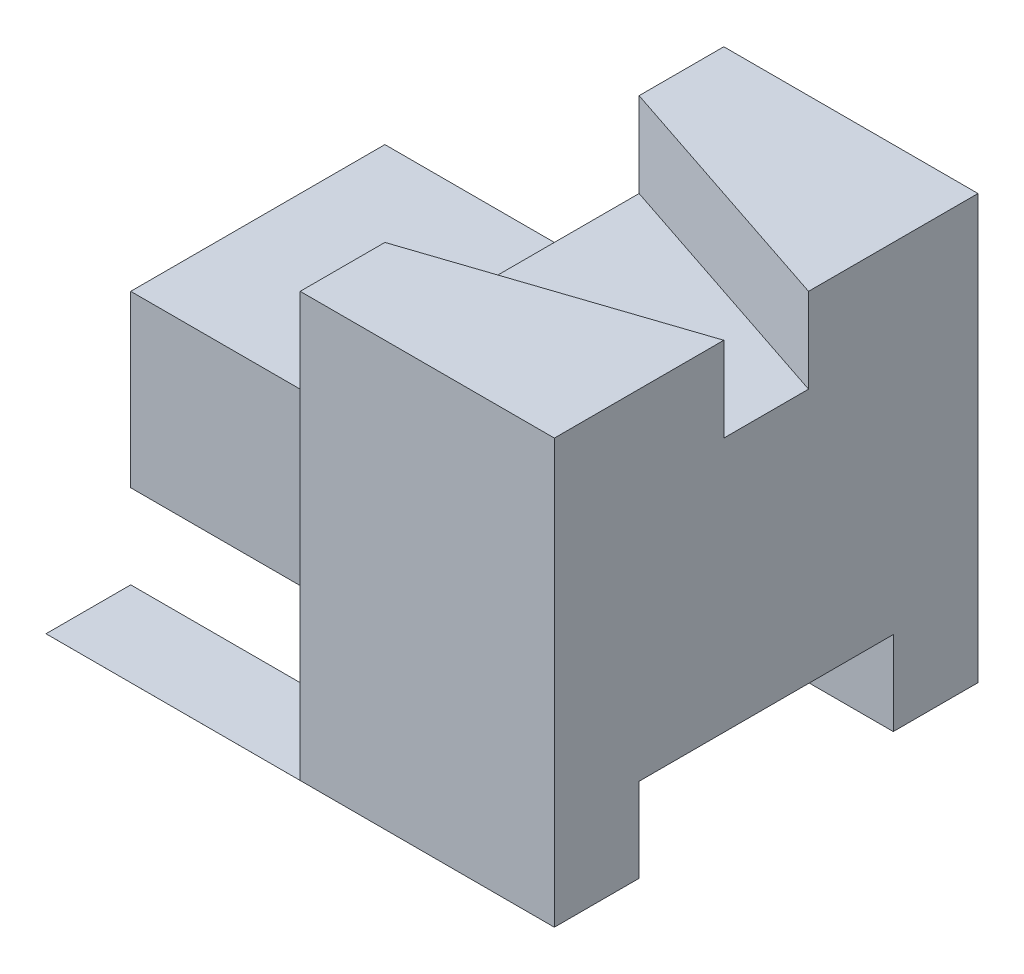
ISO-10303-21;
HEADER;
FILE_DESCRIPTION(('STEP AP214'),'2;1');
FILE_NAME('part.step','',(''),(''),'','','');
FILE_SCHEMA(('AUTOMOTIVE_DESIGN { 1 0 10303 214 1 1 1 1 }'));
ENDSEC;
DATA;
#1=APPLICATION_CONTEXT('core data for automotive mechanical design processes');
#2=APPLICATION_PROTOCOL_DEFINITION('international standard','automotive_design',2000,#1);
#3=PRODUCT_CONTEXT('',#1,'mechanical');
#4=PRODUCT('Part','Part','',(#3));
#5=PRODUCT_RELATED_PRODUCT_CATEGORY('part','',(#4));
#6=PRODUCT_DEFINITION_FORMATION('','',#4);
#7=PRODUCT_DEFINITION_CONTEXT('part definition',#1,'design');
#8=PRODUCT_DEFINITION('design','',#6,#7);
#9=PRODUCT_DEFINITION_SHAPE('','',#8);
#10=(LENGTH_UNIT() NAMED_UNIT(*) SI_UNIT(.MILLI.,.METRE.));
#11=(NAMED_UNIT(*) PLANE_ANGLE_UNIT() SI_UNIT($,.RADIAN.));
#12=(NAMED_UNIT(*) SI_UNIT($,.STERADIAN.) SOLID_ANGLE_UNIT());
#13=UNCERTAINTY_MEASURE_WITH_UNIT(LENGTH_MEASURE(1.E-05),#10,'distance_accuracy_value','');
#14=(GEOMETRIC_REPRESENTATION_CONTEXT(3) GLOBAL_UNCERTAINTY_ASSIGNED_CONTEXT((#13)) GLOBAL_UNIT_ASSIGNED_CONTEXT((#10,
#11,#12)) REPRESENTATION_CONTEXT('',''));
#15=CARTESIAN_POINT('',(0.,0.,0.));
#16=DIRECTION('',(0.,0.,1.));
#17=DIRECTION('',(1.,0.,0.));
#18=AXIS2_PLACEMENT_3D('',#15,#16,#17);
#19=CARTESIAN_POINT('',(30.,0.,40.));
#20=DIRECTION('',(0.,0.,-1.));
#21=DIRECTION('',(-1.,0.,0.));
#22=AXIS2_PLACEMENT_3D('',#19,#20,#21);
#23=PLANE('',#22);
#24=DIRECTION('',(-1.,0.,0.));
#25=VECTOR('',#24,1.);
#26=CARTESIAN_POINT('',(30.,0.,40.));
#27=LINE('',#26,#25);
#28=CARTESIAN_POINT('',(30.,0.,40.));
#29=VERTEX_POINT('',#28);
#30=CARTESIAN_POINT('',(-29.999,0.,40.));
#31=VERTEX_POINT('',#30);
#32=EDGE_CURVE('E234',#29,#31,#27,.T.);
#33=ORIENTED_EDGE('',*,*,#32,.T.);
#34=DIRECTION('',(0.,-1.,0.));
#35=VECTOR('',#34,1.);
#36=CARTESIAN_POINT('',(-29.999,0.001,40.));
#37=LINE('',#36,#35);
#38=CARTESIAN_POINT('',(-29.999,0.001,40.));
#39=VERTEX_POINT('',#38);
#40=EDGE_CURVE('E178',#39,#31,#37,.T.);
#41=ORIENTED_EDGE('',*,*,#40,.F.);
#42=DIRECTION('',(1.,0.,0.));
#43=VECTOR('',#42,1.);
#44=CARTESIAN_POINT('',(0.001,0.001,40.));
#45=LINE('',#44,#43);
#46=CARTESIAN_POINT('',(0.001,0.001,40.));
#47=VERTEX_POINT('',#46);
#48=EDGE_CURVE('E179',#39,#47,#45,.T.);
#49=ORIENTED_EDGE('',*,*,#48,.T.);
#50=DIRECTION('',(0.,-1.,0.));
#51=VECTOR('',#50,1.);
#52=CARTESIAN_POINT('',(0.001,0.,40.));
#53=LINE('',#52,#51);
#54=CARTESIAN_POINT('',(0.001,9.92,40.));
#55=VERTEX_POINT('',#54);
#56=EDGE_CURVE('E50',#55,#47,#53,.T.);
#57=ORIENTED_EDGE('',*,*,#56,.F.);
#58=DIRECTION('',(-1.,0.,0.));
#59=VECTOR('',#58,1.);
#60=CARTESIAN_POINT('',(-30.,9.92,40.));
#61=LINE('',#60,#59);
#62=CARTESIAN_POINT('',(30.,9.92,40.));
#63=VERTEX_POINT('',#62);
#64=EDGE_CURVE('E215',#63,#55,#61,.T.);
#65=ORIENTED_EDGE('',*,*,#64,.F.);
#66=DIRECTION('',(0.,-1.,0.));
#67=VECTOR('',#66,1.);
#68=CARTESIAN_POINT('',(30.,0.,40.));
#69=LINE('',#68,#67);
#70=EDGE_CURVE('E227',#63,#29,#69,.T.);
#71=ORIENTED_EDGE('',*,*,#70,.T.);
#72=EDGE_LOOP('',(#33,#41,#49,#57,#65,#71));
#73=FACE_BOUND('',#72,.T.);
#74=ADVANCED_FACE('F35',(#73),#23,.T.);
#75=CARTESIAN_POINT('',(0.,0.,50.));
#76=DIRECTION('',(0.,1.,0.));
#77=DIRECTION('',(0.,0.,1.));
#78=AXIS2_PLACEMENT_3D('',#75,#76,#77);
#79=PLANE('',#78);
#80=DIRECTION('',(1.,0.,0.));
#81=VECTOR('',#80,1.);
#82=CARTESIAN_POINT('',(0.,0.,50.));
#83=LINE('',#82,#81);
#84=CARTESIAN_POINT('',(-29.999,0.,50.));
#85=VERTEX_POINT('',#84);
#86=CARTESIAN_POINT('',(30.,0.,50.));
#87=VERTEX_POINT('',#86);
#88=EDGE_CURVE('E320',#85,#87,#83,.T.);
#89=ORIENTED_EDGE('',*,*,#88,.F.);
#90=DIRECTION('',(0.,0.,-1.));
#91=VECTOR('',#90,1.);
#92=CARTESIAN_POINT('',(-29.999,0.,50.));
#93=LINE('',#92,#91);
#94=EDGE_CURVE('E175',#85,#31,#93,.T.);
#95=ORIENTED_EDGE('',*,*,#94,.T.);
#96=ORIENTED_EDGE('',*,*,#32,.F.);
#97=DIRECTION('',(0.,0.,-1.));
#98=VECTOR('',#97,1.);
#99=CARTESIAN_POINT('',(30.,0.,50.));
#100=LINE('',#99,#98);
#101=EDGE_CURVE('E305',#87,#29,#100,.T.);
#102=ORIENTED_EDGE('',*,*,#101,.F.);
#103=EDGE_LOOP('',(#89,#95,#96,#102));
#104=FACE_BOUND('',#103,.T.);
#105=ADVANCED_FACE('F371',(#104),#79,.F.);
#106=CARTESIAN_POINT('',(-30.,30.,20.));
#107=DIRECTION('',(-1.,0.,0.));
#108=DIRECTION('',(0.,-1.,0.));
#109=AXIS2_PLACEMENT_3D('',#106,#107,#108);
#110=PLANE('',#109);
#111=DIRECTION('',(0.,0.,-1.));
#112=VECTOR('',#111,1.);
#113=CARTESIAN_POINT('',(-30.,9.92,10.));
#114=LINE('',#113,#112);
#115=CARTESIAN_POINT('',(-30.,9.91999999999999,40.));
#116=VERTEX_POINT('',#115);
#117=CARTESIAN_POINT('',(-30.,9.92,10.));
#118=VERTEX_POINT('',#117);
#119=EDGE_CURVE('E205',#116,#118,#114,.T.);
#120=ORIENTED_EDGE('',*,*,#119,.F.);
#121=DIRECTION('',(0.,-1.,0.));
#122=VECTOR('',#121,1.);
#123=CARTESIAN_POINT('',(-30.,10.,40.));
#124=LINE('',#123,#122);
#125=CARTESIAN_POINT('',(-30.,30.,40.));
#126=VERTEX_POINT('',#125);
#127=EDGE_CURVE('E338',#126,#116,#124,.T.);
#128=ORIENTED_EDGE('',*,*,#127,.F.);
#129=DIRECTION('',(0.,0.,1.));
#130=VECTOR('',#129,1.);
#131=CARTESIAN_POINT('',(-30.,30.,20.));
#132=LINE('',#131,#130);
#133=CARTESIAN_POINT('',(-30.,30.,10.));
#134=VERTEX_POINT('',#133);
#135=EDGE_CURVE('E328',#134,#126,#132,.T.);
#136=ORIENTED_EDGE('',*,*,#135,.F.);
#137=DIRECTION('',(0.,1.,0.));
#138=VECTOR('',#137,1.);
#139=CARTESIAN_POINT('',(-30.,30.,10.));
#140=LINE('',#139,#138);
#141=EDGE_CURVE('E303',#118,#134,#140,.T.);
#142=ORIENTED_EDGE('',*,*,#141,.F.);
#143=EDGE_LOOP('',(#120,#128,#136,#142));
#144=FACE_BOUND('',#143,.T.);
#145=ADVANCED_FACE('F397',(#144),#110,.T.);
#146=CARTESIAN_POINT('',(30.,0.,10.));
#147=DIRECTION('',(0.,0.,1.));
#148=DIRECTION('',(1.,0.,0.));
#149=AXIS2_PLACEMENT_3D('',#146,#147,#148);
#150=PLANE('',#149);
#151=DIRECTION('',(0.,1.,0.));
#152=VECTOR('',#151,1.);
#153=CARTESIAN_POINT('',(30.,0.,10.));
#154=LINE('',#153,#152);
#155=CARTESIAN_POINT('',(30.,0.,10.));
#156=VERTEX_POINT('',#155);
#157=CARTESIAN_POINT('',(30.,9.92,10.));
#158=VERTEX_POINT('',#157);
#159=EDGE_CURVE('E229',#156,#158,#154,.T.);
#160=ORIENTED_EDGE('',*,*,#159,.T.);
#161=DIRECTION('',(-1.,0.,0.));
#162=VECTOR('',#161,1.);
#163=CARTESIAN_POINT('',(30.,9.92,10.));
#164=LINE('',#163,#162);
#165=CARTESIAN_POINT('',(-22.56,9.92,10.));
#166=VERTEX_POINT('',#165);
#167=EDGE_CURVE('E11',#158,#166,#164,.T.);
#168=ORIENTED_EDGE('',*,*,#167,.T.);
#169=DIRECTION('',(0.6,0.8,0.));
#170=VECTOR('',#169,1.);
#171=CARTESIAN_POINT('',(-30.,0.,10.));
#172=LINE('',#171,#170);
#173=CARTESIAN_POINT('',(-30.,0.,10.));
#174=VERTEX_POINT('',#173);
#175=EDGE_CURVE('E43',#174,#166,#172,.T.);
#176=ORIENTED_EDGE('',*,*,#175,.F.);
#177=DIRECTION('',(-1.,0.,0.));
#178=VECTOR('',#177,1.);
#179=CARTESIAN_POINT('',(30.,0.,10.));
#180=LINE('',#179,#178);
#181=EDGE_CURVE('E231',#156,#174,#180,.T.);
#182=ORIENTED_EDGE('',*,*,#181,.F.);
#183=EDGE_LOOP('',(#160,#168,#176,#182));
#184=FACE_BOUND('',#183,.T.);
#185=ADVANCED_FACE('F362',(#184),#150,.T.);
#186=CARTESIAN_POINT('',(-30.,0.,0.));
#187=DIRECTION('',(-0.8,0.6,0.));
#188=DIRECTION('',(-0.6,-0.8,0.));
#189=AXIS2_PLACEMENT_3D('',#186,#187,#188);
#190=PLANE('',#189);
#191=DIRECTION('',(0.6,0.8,0.));
#192=VECTOR('',#191,1.);
#193=CARTESIAN_POINT('',(-19.2,14.4,10.));
#194=LINE('',#193,#192);
#195=CARTESIAN_POINT('',(-7.5,30.,10.));
#196=VERTEX_POINT('',#195);
#197=EDGE_CURVE('E285',#166,#196,#194,.T.);
#198=ORIENTED_EDGE('',*,*,#197,.T.);
#199=DIRECTION('',(-0.6,-0.8,0.));
#200=VECTOR('',#199,1.);
#201=CARTESIAN_POINT('',(0.,40.,10.));
#202=LINE('',#201,#200);
#203=CARTESIAN_POINT('',(0.,40.,10.));
#204=VERTEX_POINT('',#203);
#205=EDGE_CURVE('E218',#204,#196,#202,.T.);
#206=ORIENTED_EDGE('',*,*,#205,.F.);
#207=DIRECTION('',(0.,0.,1.));
#208=VECTOR('',#207,1.);
#209=CARTESIAN_POINT('',(0.,40.,0.));
#210=LINE('',#209,#208);
#211=CARTESIAN_POINT('',(0.,40.,0.));
#212=VERTEX_POINT('',#211);
#213=EDGE_CURVE('E289',#212,#204,#210,.T.);
#214=ORIENTED_EDGE('',*,*,#213,.F.);
#215=DIRECTION('',(-0.6,-0.8,0.));
#216=VECTOR('',#215,1.);
#217=CARTESIAN_POINT('',(-30.,0.,0.));
#218=LINE('',#217,#216);
#219=CARTESIAN_POINT('',(-30.,0.,0.));
#220=VERTEX_POINT('',#219);
#221=EDGE_CURVE('E277',#212,#220,#218,.T.);
#222=ORIENTED_EDGE('',*,*,#221,.T.);
#223=DIRECTION('',(0.,0.,1.));
#224=VECTOR('',#223,1.);
#225=CARTESIAN_POINT('',(-30.,0.,0.));
#226=LINE('',#225,#224);
#227=EDGE_CURVE('E282',#220,#174,#226,.T.);
#228=ORIENTED_EDGE('',*,*,#227,.T.);
#229=ORIENTED_EDGE('',*,*,#175,.T.);
#230=EDGE_LOOP('',(#198,#206,#214,#222,#228,#229));
#231=FACE_BOUND('',#230,.T.);
#232=ADVANCED_FACE('F359',(#231),#190,.T.);
#233=CARTESIAN_POINT('',(0.,0.,50.));
#234=DIRECTION('',(1.,0.,0.));
#235=DIRECTION('',(0.,0.,-1.));
#236=AXIS2_PLACEMENT_3D('',#233,#234,#235);
#237=PLANE('',#236);
#238=DIRECTION('',(0.,1.,0.));
#239=VECTOR('',#238,1.);
#240=CARTESIAN_POINT('',(0.,10.,40.));
#241=LINE('',#240,#239);
#242=CARTESIAN_POINT('',(0.,9.92,40.));
#243=VERTEX_POINT('',#242);
#244=CARTESIAN_POINT('',(0.,30.,40.));
#245=VERTEX_POINT('',#244);
#246=EDGE_CURVE('E343',#243,#245,#241,.T.);
#247=ORIENTED_EDGE('',*,*,#246,.F.);
#248=DIRECTION('',(0.,0.,-1.));
#249=VECTOR('',#248,1.);
#250=CARTESIAN_POINT('',(0.,9.92,50.));
#251=LINE('',#250,#249);
#252=CARTESIAN_POINT('',(0.,9.92,50.));
#253=VERTEX_POINT('',#252);
#254=EDGE_CURVE('E196',#253,#243,#251,.T.);
#255=ORIENTED_EDGE('',*,*,#254,.F.);
#256=DIRECTION('',(0.,-1.,0.));
#257=VECTOR('',#256,1.);
#258=CARTESIAN_POINT('',(0.,0.,50.));
#259=LINE('',#258,#257);
#260=CARTESIAN_POINT('',(0.,50.,50.));
#261=VERTEX_POINT('',#260);
#262=EDGE_CURVE('E318',#261,#253,#259,.T.);
#263=ORIENTED_EDGE('',*,*,#262,.F.);
#264=DIRECTION('',(0.,0.,1.));
#265=VECTOR('',#264,1.);
#266=CARTESIAN_POINT('',(0.,50.,45.));
#267=LINE('',#266,#265);
#268=CARTESIAN_POINT('',(0.,50.,40.));
#269=VERTEX_POINT('',#268);
#270=EDGE_CURVE('E274',#269,#261,#267,.T.);
#271=ORIENTED_EDGE('',*,*,#270,.F.);
#272=DIRECTION('',(0.,1.,0.));
#273=VECTOR('',#272,1.);
#274=CARTESIAN_POINT('',(0.,50.,40.));
#275=LINE('',#274,#273);
#276=CARTESIAN_POINT('',(0.,40.,40.));
#277=VERTEX_POINT('',#276);
#278=EDGE_CURVE('E267',#277,#269,#275,.T.);
#279=ORIENTED_EDGE('',*,*,#278,.F.);
#280=EDGE_CURVE('E288',#204,#277,#210,.T.);
#281=ORIENTED_EDGE('',*,*,#280,.F.);
#282=DIRECTION('',(0.,1.,0.));
#283=VECTOR('',#282,1.);
#284=CARTESIAN_POINT('',(0.,30.,10.));
#285=LINE('',#284,#283);
#286=CARTESIAN_POINT('',(0.,30.,10.));
#287=VERTEX_POINT('',#286);
#288=EDGE_CURVE('E224',#287,#204,#285,.T.);
#289=ORIENTED_EDGE('',*,*,#288,.F.);
#290=DIRECTION('',(0.,0.,1.));
#291=VECTOR('',#290,1.);
#292=CARTESIAN_POINT('',(0.,30.,20.));
#293=LINE('',#292,#291);
#294=EDGE_CURVE('E300',#287,#245,#293,.T.);
#295=ORIENTED_EDGE('',*,*,#294,.T.);
#296=EDGE_LOOP('',(#247,#255,#263,#271,#279,#281,#289,#295));
#297=FACE_BOUND('',#296,.T.);
#298=ADVANCED_FACE('F37',(#297),#237,.F.);
#299=CARTESIAN_POINT('',(30.,0.,50.));
#300=DIRECTION('',(-1.,0.,0.));
#301=DIRECTION('',(0.,0.,1.));
#302=AXIS2_PLACEMENT_3D('',#299,#300,#301);
#303=PLANE('',#302);
#304=ORIENTED_EDGE('',*,*,#70,.F.);
#305=DIRECTION('',(0.,0.,1.));
#306=VECTOR('',#305,1.);
#307=CARTESIAN_POINT('',(30.,9.92,10.));
#308=LINE('',#307,#306);
#309=EDGE_CURVE('E211',#158,#63,#308,.T.);
#310=ORIENTED_EDGE('',*,*,#309,.F.);
#311=ORIENTED_EDGE('',*,*,#159,.F.);
#312=CARTESIAN_POINT('',(30.,0.,0.));
#313=VERTEX_POINT('',#312);
#314=EDGE_CURVE('E308',#156,#313,#100,.T.);
#315=ORIENTED_EDGE('',*,*,#314,.T.);
#316=DIRECTION('',(0.,1.,0.));
#317=VECTOR('',#316,1.);
#318=CARTESIAN_POINT('',(30.,0.,0.));
#319=LINE('',#318,#317);
#320=CARTESIAN_POINT('',(30.,50.,0.));
#321=VERTEX_POINT('',#320);
#322=EDGE_CURVE('E316',#313,#321,#319,.T.);
#323=ORIENTED_EDGE('',*,*,#322,.T.);
#324=DIRECTION('',(0.,0.,-1.));
#325=VECTOR('',#324,1.);
#326=CARTESIAN_POINT('',(30.,50.,0.));
#327=LINE('',#326,#325);
#328=CARTESIAN_POINT('',(30.,50.,20.));
#329=VERTEX_POINT('',#328);
#330=EDGE_CURVE('E242',#329,#321,#327,.T.);
#331=ORIENTED_EDGE('',*,*,#330,.F.);
#332=DIRECTION('',(0.,-1.,0.));
#333=VECTOR('',#332,1.);
#334=CARTESIAN_POINT('',(30.,50.,20.));
#335=LINE('',#334,#333);
#336=CARTESIAN_POINT('',(30.,40.,20.));
#337=VERTEX_POINT('',#336);
#338=EDGE_CURVE('E252',#329,#337,#335,.T.);
#339=ORIENTED_EDGE('',*,*,#338,.T.);
#340=DIRECTION('',(0.,0.,-1.));
#341=VECTOR('',#340,1.);
#342=CARTESIAN_POINT('',(30.,40.,0.));
#343=LINE('',#342,#341);
#344=CARTESIAN_POINT('',(30.,40.,30.));
#345=VERTEX_POINT('',#344);
#346=EDGE_CURVE('E293',#345,#337,#343,.T.);
#347=ORIENTED_EDGE('',*,*,#346,.F.);
#348=DIRECTION('',(0.,-1.,0.));
#349=VECTOR('',#348,1.);
#350=CARTESIAN_POINT('',(30.,50.,30.));
#351=LINE('',#350,#349);
#352=CARTESIAN_POINT('',(30.,50.,30.));
#353=VERTEX_POINT('',#352);
#354=EDGE_CURVE('E262',#353,#345,#351,.T.);
#355=ORIENTED_EDGE('',*,*,#354,.F.);
#356=DIRECTION('',(0.,0.,1.));
#357=VECTOR('',#356,1.);
#358=CARTESIAN_POINT('',(30.,50.,45.));
#359=LINE('',#358,#357);
#360=CARTESIAN_POINT('',(30.,50.,50.));
#361=VERTEX_POINT('',#360);
#362=EDGE_CURVE('E273',#353,#361,#359,.T.);
#363=ORIENTED_EDGE('',*,*,#362,.T.);
#364=DIRECTION('',(0.,1.,0.));
#365=VECTOR('',#364,1.);
#366=CARTESIAN_POINT('',(30.,0.,50.));
#367=LINE('',#366,#365);
#368=EDGE_CURVE('E314',#87,#361,#367,.T.);
#369=ORIENTED_EDGE('',*,*,#368,.F.);
#370=ORIENTED_EDGE('',*,*,#101,.T.);
#371=EDGE_LOOP('',(#304,#310,#311,#315,#323,#331,#339,#347,#355,#363,#369,#370));
#372=FACE_BOUND('',#371,.T.);
#373=ADVANCED_FACE('F367',(#372),#303,.F.);
#374=ORIENTED_EDGE('',*,*,#181,.T.);
#375=ORIENTED_EDGE('',*,*,#227,.F.);
#376=DIRECTION('',(1.,0.,0.));
#377=VECTOR('',#376,1.);
#378=CARTESIAN_POINT('',(0.,0.,0.));
#379=LINE('',#378,#377);
#380=EDGE_CURVE('E326',#220,#313,#379,.T.);
#381=ORIENTED_EDGE('',*,*,#380,.T.);
#382=ORIENTED_EDGE('',*,*,#314,.F.);
#383=EDGE_LOOP('',(#374,#375,#381,#382));
#384=FACE_BOUND('',#383,.T.);
#385=ADVANCED_FACE('F398',(#384),#79,.F.);
#386=CARTESIAN_POINT('',(0.,40.,0.));
#387=DIRECTION('',(0.,1.,0.));
#388=DIRECTION('',(0.,0.,1.));
#389=AXIS2_PLACEMENT_3D('',#386,#387,#388);
#390=PLANE('',#389);
#391=ORIENTED_EDGE('',*,*,#346,.T.);
#392=DIRECTION('',(0.948683298050514,0.,0.316227766016838));
#393=VECTOR('',#392,1.);
#394=CARTESIAN_POINT('',(30.,40.,20.));
#395=LINE('',#394,#393);
#396=EDGE_CURVE('E236',#204,#337,#395,.T.);
#397=ORIENTED_EDGE('',*,*,#396,.F.);
#398=ORIENTED_EDGE('',*,*,#280,.T.);
#399=DIRECTION('',(-0.948683298050514,0.,0.316227766016838));
#400=VECTOR('',#399,1.);
#401=CARTESIAN_POINT('',(0.,40.,40.));
#402=LINE('',#401,#400);
#403=EDGE_CURVE('E258',#345,#277,#402,.T.);
#404=ORIENTED_EDGE('',*,*,#403,.F.);
#405=EDGE_LOOP('',(#391,#397,#398,#404));
#406=FACE_BOUND('',#405,.T.);
#407=ADVANCED_FACE('F422',(#406),#390,.T.);
#408=CARTESIAN_POINT('',(0.,0.,50.));
#409=DIRECTION('',(0.,0.,-1.));
#410=DIRECTION('',(-1.,0.,0.));
#411=AXIS2_PLACEMENT_3D('',#408,#409,#410);
#412=PLANE('',#411);
#413=ORIENTED_EDGE('',*,*,#262,.T.);
#414=DIRECTION('',(-1.,0.,0.));
#415=VECTOR('',#414,1.);
#416=CARTESIAN_POINT('',(0.001,9.92,50.));
#417=LINE('',#416,#415);
#418=CARTESIAN_POINT('',(0.001,9.92,50.));
#419=VERTEX_POINT('',#418);
#420=EDGE_CURVE('E202',#419,#253,#417,.T.);
#421=ORIENTED_EDGE('',*,*,#420,.F.);
#422=DIRECTION('',(0.,1.,0.));
#423=VECTOR('',#422,1.);
#424=CARTESIAN_POINT('',(0.001,0.,50.));
#425=LINE('',#424,#423);
#426=CARTESIAN_POINT('',(0.001,0.001,50.));
#427=VERTEX_POINT('',#426);
#428=EDGE_CURVE('E190',#427,#419,#425,.T.);
#429=ORIENTED_EDGE('',*,*,#428,.F.);
#430=DIRECTION('',(-1.,0.,0.));
#431=VECTOR('',#430,1.);
#432=CARTESIAN_POINT('',(0.001,0.001,50.));
#433=LINE('',#432,#431);
#434=CARTESIAN_POINT('',(-29.999,0.001,50.));
#435=VERTEX_POINT('',#434);
#436=EDGE_CURVE('E184',#427,#435,#433,.T.);
#437=ORIENTED_EDGE('',*,*,#436,.T.);
#438=DIRECTION('',(0.,-1.,0.));
#439=VECTOR('',#438,1.);
#440=CARTESIAN_POINT('',(-29.999,0.001,50.));
#441=LINE('',#440,#439);
#442=EDGE_CURVE('E168',#435,#85,#441,.T.);
#443=ORIENTED_EDGE('',*,*,#442,.T.);
#444=ORIENTED_EDGE('',*,*,#88,.T.);
#445=ORIENTED_EDGE('',*,*,#368,.T.);
#446=DIRECTION('',(-1.,0.,0.));
#447=VECTOR('',#446,1.);
#448=CARTESIAN_POINT('',(30.,50.,50.));
#449=LINE('',#448,#447);
#450=EDGE_CURVE('E270',#361,#261,#449,.T.);
#451=ORIENTED_EDGE('',*,*,#450,.T.);
#452=EDGE_LOOP('',(#413,#421,#429,#437,#443,#444,#445,#451));
#453=FACE_BOUND('',#452,.T.);
#454=ADVANCED_FACE('F188',(#453),#412,.F.);
#455=CARTESIAN_POINT('',(0.,0.,0.));
#456=DIRECTION('',(0.,0.,-1.));
#457=DIRECTION('',(-1.,0.,0.));
#458=AXIS2_PLACEMENT_3D('',#455,#456,#457);
#459=PLANE('',#458);
#460=ORIENTED_EDGE('',*,*,#380,.F.);
#461=ORIENTED_EDGE('',*,*,#221,.F.);
#462=DIRECTION('',(0.,-1.,0.));
#463=VECTOR('',#462,1.);
#464=CARTESIAN_POINT('',(0.,50.,0.));
#465=LINE('',#464,#463);
#466=CARTESIAN_POINT('',(0.,50.,0.));
#467=VERTEX_POINT('',#466);
#468=EDGE_CURVE('E247',#467,#212,#465,.T.);
#469=ORIENTED_EDGE('',*,*,#468,.F.);
#470=DIRECTION('',(-1.,0.,0.));
#471=VECTOR('',#470,1.);
#472=CARTESIAN_POINT('',(0.,50.,0.));
#473=LINE('',#472,#471);
#474=EDGE_CURVE('E245',#321,#467,#473,.T.);
#475=ORIENTED_EDGE('',*,*,#474,.F.);
#476=ORIENTED_EDGE('',*,*,#322,.F.);
#477=EDGE_LOOP('',(#460,#461,#469,#475,#476));
#478=FACE_BOUND('',#477,.T.);
#479=ADVANCED_FACE('F436',(#478),#459,.T.);
#480=CARTESIAN_POINT('',(0.,30.,20.));
#481=DIRECTION('',(0.,1.,0.));
#482=DIRECTION('',(-1.,0.,0.));
#483=AXIS2_PLACEMENT_3D('',#480,#481,#482);
#484=PLANE('',#483);
#485=DIRECTION('',(1.,0.,0.));
#486=VECTOR('',#485,1.);
#487=CARTESIAN_POINT('',(-7.5,30.,10.));
#488=LINE('',#487,#486);
#489=EDGE_CURVE('E221',#196,#287,#488,.T.);
#490=ORIENTED_EDGE('',*,*,#489,.F.);
#491=DIRECTION('',(1.,0.,0.));
#492=VECTOR('',#491,1.);
#493=CARTESIAN_POINT('',(0.,30.,10.));
#494=LINE('',#493,#492);
#495=EDGE_CURVE('E345',#134,#196,#494,.T.);
#496=ORIENTED_EDGE('',*,*,#495,.F.);
#497=ORIENTED_EDGE('',*,*,#135,.T.);
#498=DIRECTION('',(-1.,0.,0.));
#499=VECTOR('',#498,1.);
#500=CARTESIAN_POINT('',(0.,30.,40.));
#501=LINE('',#500,#499);
#502=EDGE_CURVE('E341',#245,#126,#501,.T.);
#503=ORIENTED_EDGE('',*,*,#502,.F.);
#504=ORIENTED_EDGE('',*,*,#294,.F.);
#505=EDGE_LOOP('',(#490,#496,#497,#503,#504));
#506=FACE_BOUND('',#505,.T.);
#507=ADVANCED_FACE('F353',(#506),#484,.T.);
#508=CARTESIAN_POINT('',(0.,0.,40.));
#509=DIRECTION('',(0.,0.,1.));
#510=DIRECTION('',(1.,0.,0.));
#511=AXIS2_PLACEMENT_3D('',#508,#509,#510);
#512=PLANE('',#511);
#513=ORIENTED_EDGE('',*,*,#127,.T.);
#514=EDGE_CURVE('E214',#243,#116,#61,.T.);
#515=ORIENTED_EDGE('',*,*,#514,.F.);
#516=ORIENTED_EDGE('',*,*,#246,.T.);
#517=ORIENTED_EDGE('',*,*,#502,.T.);
#518=EDGE_LOOP('',(#513,#515,#516,#517));
#519=FACE_BOUND('',#518,.T.);
#520=ADVANCED_FACE('F428',(#519),#512,.T.);
#521=CARTESIAN_POINT('',(0.,0.,10.));
#522=DIRECTION('',(0.,0.,-1.));
#523=DIRECTION('',(-1.,0.,0.));
#524=AXIS2_PLACEMENT_3D('',#521,#522,#523);
#525=PLANE('',#524);
#526=ORIENTED_EDGE('',*,*,#197,.F.);
#527=DIRECTION('',(1.,0.,0.));
#528=VECTOR('',#527,1.);
#529=CARTESIAN_POINT('',(-30.,9.92,10.));
#530=LINE('',#529,#528);
#531=EDGE_CURVE('E208',#118,#166,#530,.T.);
#532=ORIENTED_EDGE('',*,*,#531,.F.);
#533=ORIENTED_EDGE('',*,*,#141,.T.);
#534=ORIENTED_EDGE('',*,*,#495,.T.);
#535=EDGE_LOOP('',(#526,#532,#533,#534));
#536=FACE_BOUND('',#535,.T.);
#537=ADVANCED_FACE('F350',(#536),#525,.T.);
#538=CARTESIAN_POINT('',(30.,50.,45.));
#539=DIRECTION('',(0.,1.,0.));
#540=DIRECTION('',(-1.,0.,0.));
#541=AXIS2_PLACEMENT_3D('',#538,#539,#540);
#542=PLANE('',#541);
#543=ORIENTED_EDGE('',*,*,#450,.F.);
#544=ORIENTED_EDGE('',*,*,#362,.F.);
#545=DIRECTION('',(-0.948683298050514,0.,0.316227766016838));
#546=VECTOR('',#545,1.);
#547=CARTESIAN_POINT('',(0.,50.,40.));
#548=LINE('',#547,#546);
#549=EDGE_CURVE('E259',#353,#269,#548,.T.);
#550=ORIENTED_EDGE('',*,*,#549,.T.);
#551=ORIENTED_EDGE('',*,*,#270,.T.);
#552=EDGE_LOOP('',(#543,#544,#550,#551));
#553=FACE_BOUND('',#552,.T.);
#554=ADVANCED_FACE('F377',(#553),#542,.T.);
#555=CARTESIAN_POINT('',(0.,50.,40.));
#556=DIRECTION('',(0.316227766016838,0.,0.948683298050514));
#557=DIRECTION('',(0.948683298050514,0.,-0.316227766016838));
#558=AXIS2_PLACEMENT_3D('',#555,#556,#557);
#559=PLANE('',#558);
#560=ORIENTED_EDGE('',*,*,#403,.T.);
#561=ORIENTED_EDGE('',*,*,#278,.T.);
#562=ORIENTED_EDGE('',*,*,#549,.F.);
#563=ORIENTED_EDGE('',*,*,#354,.T.);
#564=EDGE_LOOP('',(#560,#561,#562,#563));
#565=FACE_BOUND('',#564,.T.);
#566=ADVANCED_FACE('F413',(#565),#559,.F.);
#567=CARTESIAN_POINT('',(0.,50.,10.));
#568=DIRECTION('',(1.,0.,0.));
#569=DIRECTION('',(0.,0.,-1.));
#570=AXIS2_PLACEMENT_3D('',#567,#568,#569);
#571=PLANE('',#570);
#572=ORIENTED_EDGE('',*,*,#213,.T.);
#573=DIRECTION('',(0.,-1.,0.));
#574=VECTOR('',#573,1.);
#575=CARTESIAN_POINT('',(0.,50.,10.));
#576=LINE('',#575,#574);
#577=CARTESIAN_POINT('',(0.,50.,10.));
#578=VERTEX_POINT('',#577);
#579=EDGE_CURVE('E255',#578,#204,#576,.T.);
#580=ORIENTED_EDGE('',*,*,#579,.F.);
#581=DIRECTION('',(0.,0.,1.));
#582=VECTOR('',#581,1.);
#583=CARTESIAN_POINT('',(0.,50.,10.));
#584=LINE('',#583,#582);
#585=EDGE_CURVE('E237',#467,#578,#584,.T.);
#586=ORIENTED_EDGE('',*,*,#585,.F.);
#587=ORIENTED_EDGE('',*,*,#468,.T.);
#588=EDGE_LOOP('',(#572,#580,#586,#587));
#589=FACE_BOUND('',#588,.T.);
#590=ADVANCED_FACE('F409',(#589),#571,.F.);
#591=CARTESIAN_POINT('',(30.,50.,20.));
#592=DIRECTION('',(0.316227766016838,0.,-0.948683298050514));
#593=DIRECTION('',(-0.948683298050514,0.,-0.316227766016838));
#594=AXIS2_PLACEMENT_3D('',#591,#592,#593);
#595=PLANE('',#594);
#596=ORIENTED_EDGE('',*,*,#396,.T.);
#597=ORIENTED_EDGE('',*,*,#338,.F.);
#598=DIRECTION('',(0.948683298050514,0.,0.316227766016838));
#599=VECTOR('',#598,1.);
#600=CARTESIAN_POINT('',(30.,50.,20.));
#601=LINE('',#600,#599);
#602=EDGE_CURVE('E240',#578,#329,#601,.T.);
#603=ORIENTED_EDGE('',*,*,#602,.F.);
#604=ORIENTED_EDGE('',*,*,#579,.T.);
#605=EDGE_LOOP('',(#596,#597,#603,#604));
#606=FACE_BOUND('',#605,.T.);
#607=ADVANCED_FACE('F405',(#606),#595,.F.);
#608=CARTESIAN_POINT('',(0.,50.,0.));
#609=DIRECTION('',(0.,-1.,0.));
#610=DIRECTION('',(0.,0.,-1.));
#611=AXIS2_PLACEMENT_3D('',#608,#609,#610);
#612=PLANE('',#611);
#613=ORIENTED_EDGE('',*,*,#585,.T.);
#614=ORIENTED_EDGE('',*,*,#602,.T.);
#615=ORIENTED_EDGE('',*,*,#330,.T.);
#616=ORIENTED_EDGE('',*,*,#474,.T.);
#617=EDGE_LOOP('',(#613,#614,#615,#616));
#618=FACE_BOUND('',#617,.T.);
#619=ADVANCED_FACE('F402',(#618),#612,.F.);
#620=CARTESIAN_POINT('',(0.,0.,10.));
#621=DIRECTION('',(0.,0.,1.));
#622=DIRECTION('',(1.,0.,0.));
#623=AXIS2_PLACEMENT_3D('',#620,#621,#622);
#624=PLANE('',#623);
#625=ORIENTED_EDGE('',*,*,#205,.T.);
#626=ORIENTED_EDGE('',*,*,#489,.T.);
#627=ORIENTED_EDGE('',*,*,#288,.T.);
#628=EDGE_LOOP('',(#625,#626,#627));
#629=FACE_BOUND('',#628,.T.);
#630=ADVANCED_FACE('F357',(#629),#624,.T.);
#631=CARTESIAN_POINT('',(0.,9.92,0.));
#632=DIRECTION('',(0.,1.,0.));
#633=DIRECTION('',(-1.,0.,0.));
#634=AXIS2_PLACEMENT_3D('',#631,#632,#633);
#635=PLANE('',#634);
#636=ORIENTED_EDGE('',*,*,#119,.T.);
#637=ORIENTED_EDGE('',*,*,#531,.T.);
#638=ORIENTED_EDGE('',*,*,#167,.F.);
#639=ORIENTED_EDGE('',*,*,#309,.T.);
#640=ORIENTED_EDGE('',*,*,#64,.T.);
#641=DIRECTION('',(0.,0.,-1.));
#642=VECTOR('',#641,1.);
#643=CARTESIAN_POINT('',(0.001,9.92,50.));
#644=LINE('',#643,#642);
#645=EDGE_CURVE('E199',#419,#55,#644,.T.);
#646=ORIENTED_EDGE('',*,*,#645,.F.);
#647=ORIENTED_EDGE('',*,*,#420,.T.);
#648=ORIENTED_EDGE('',*,*,#254,.T.);
#649=ORIENTED_EDGE('',*,*,#514,.T.);
#650=EDGE_LOOP('',(#636,#637,#638,#639,#640,#646,#647,#648,#649));
#651=FACE_BOUND('',#650,.T.);
#652=ADVANCED_FACE('F366',(#651),#635,.F.);
#653=CARTESIAN_POINT('',(0.001,0.,0.));
#654=DIRECTION('',(-1.,0.,0.));
#655=DIRECTION('',(0.,0.,1.));
#656=AXIS2_PLACEMENT_3D('',#653,#654,#655);
#657=PLANE('',#656);
#658=DIRECTION('',(0.,0.,1.));
#659=VECTOR('',#658,1.);
#660=CARTESIAN_POINT('',(0.001,0.001,50.));
#661=LINE('',#660,#659);
#662=EDGE_CURVE('E54',#47,#427,#661,.T.);
#663=ORIENTED_EDGE('',*,*,#662,.T.);
#664=ORIENTED_EDGE('',*,*,#428,.T.);
#665=ORIENTED_EDGE('',*,*,#645,.T.);
#666=ORIENTED_EDGE('',*,*,#56,.T.);
#667=EDGE_LOOP('',(#663,#664,#665,#666));
#668=FACE_BOUND('',#667,.T.);
#669=ADVANCED_FACE('F383',(#668),#657,.T.);
#670=CARTESIAN_POINT('',(-29.999,0.001,50.));
#671=DIRECTION('',(-1.,0.,0.));
#672=DIRECTION('',(0.,0.,1.));
#673=AXIS2_PLACEMENT_3D('',#670,#671,#672);
#674=PLANE('',#673);
#675=ORIENTED_EDGE('',*,*,#94,.F.);
#676=ORIENTED_EDGE('',*,*,#442,.F.);
#677=DIRECTION('',(0.,0.,-1.));
#678=VECTOR('',#677,1.);
#679=CARTESIAN_POINT('',(-29.999,0.001,50.));
#680=LINE('',#679,#678);
#681=EDGE_CURVE('E172',#435,#39,#680,.T.);
#682=ORIENTED_EDGE('',*,*,#681,.T.);
#683=ORIENTED_EDGE('',*,*,#40,.T.);
#684=EDGE_LOOP('',(#675,#676,#682,#683));
#685=FACE_BOUND('',#684,.T.);
#686=ADVANCED_FACE('F170',(#685),#674,.T.);
#687=CARTESIAN_POINT('',(0.,0.001,0.));
#688=DIRECTION('',(0.,1.,0.));
#689=DIRECTION('',(0.,0.,1.));
#690=AXIS2_PLACEMENT_3D('',#687,#688,#689);
#691=PLANE('',#690);
#692=ORIENTED_EDGE('',*,*,#662,.F.);
#693=ORIENTED_EDGE('',*,*,#48,.F.);
#694=ORIENTED_EDGE('',*,*,#681,.F.);
#695=ORIENTED_EDGE('',*,*,#436,.F.);
#696=EDGE_LOOP('',(#692,#693,#694,#695));
#697=FACE_BOUND('',#696,.T.);
#698=ADVANCED_FACE('F183',(#697),#691,.T.);
#699=CLOSED_SHELL('',(#74,#105,#145,#185,#232,#298,#373,#385,#407,#454,#479,#507,#520,#537,#554,
#566,#590,#607,#619,#630,#652,#669,#686,#698));
#700=MANIFOLD_SOLID_BREP('B2',#699);
#701=ADVANCED_BREP_SHAPE_REPRESENTATION('',(#18,#700),#14);
#702=SHAPE_DEFINITION_REPRESENTATION(#9,#701);
ENDSEC;
END-ISO-10303-21;
